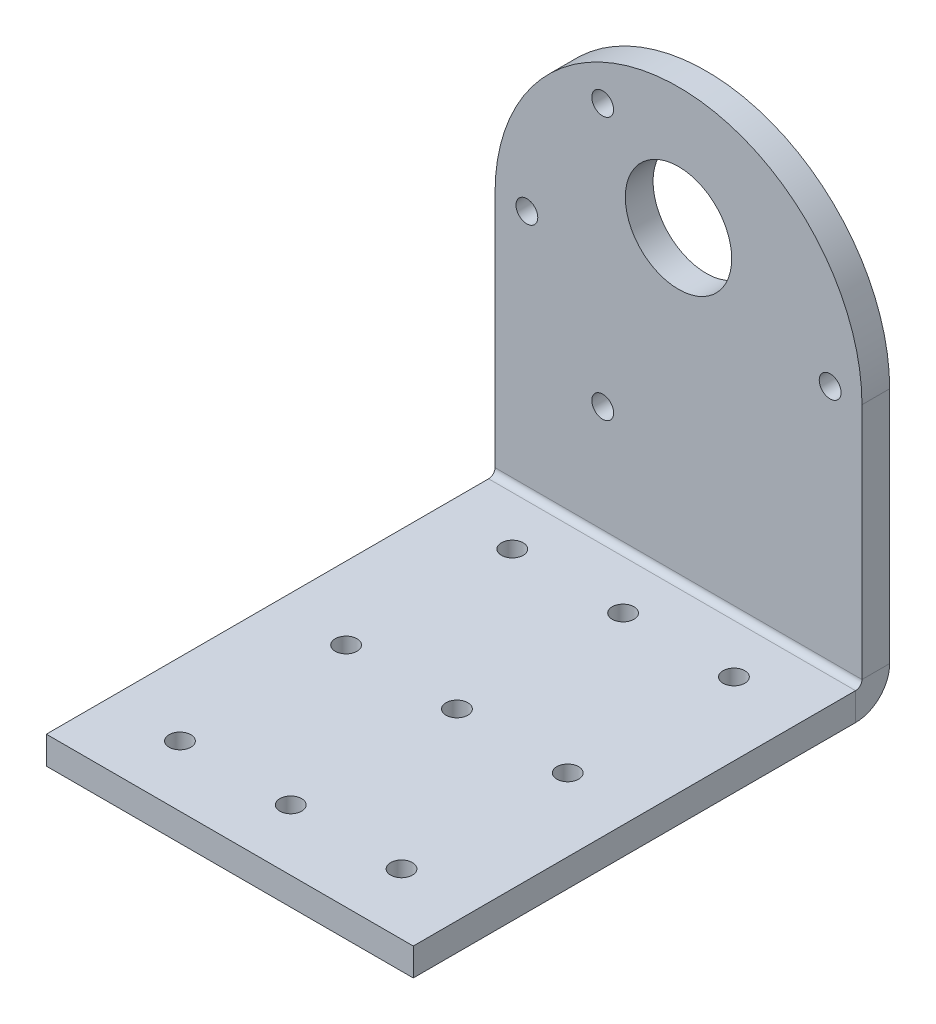
ISO-10303-21;
HEADER;
FILE_DESCRIPTION(('STEP AP214'),'2;1');
FILE_NAME('part.step','',(''),(''),'','','');
FILE_SCHEMA(('AUTOMOTIVE_DESIGN { 1 0 10303 214 1 1 1 1 }'));
ENDSEC;
DATA;
#1=APPLICATION_CONTEXT('core data for automotive mechanical design processes');
#2=APPLICATION_PROTOCOL_DEFINITION('international standard','automotive_design',2000,#1);
#3=PRODUCT_CONTEXT('',#1,'mechanical');
#4=PRODUCT('Part','Part','',(#3));
#5=PRODUCT_RELATED_PRODUCT_CATEGORY('part','',(#4));
#6=PRODUCT_DEFINITION_FORMATION('','',#4);
#7=PRODUCT_DEFINITION_CONTEXT('part definition',#1,'design');
#8=PRODUCT_DEFINITION('design','',#6,#7);
#9=PRODUCT_DEFINITION_SHAPE('','',#8);
#10=(LENGTH_UNIT() NAMED_UNIT(*) SI_UNIT(.MILLI.,.METRE.));
#11=(NAMED_UNIT(*) PLANE_ANGLE_UNIT() SI_UNIT($,.RADIAN.));
#12=(NAMED_UNIT(*) SI_UNIT($,.STERADIAN.) SOLID_ANGLE_UNIT());
#13=UNCERTAINTY_MEASURE_WITH_UNIT(LENGTH_MEASURE(1.E-05),#10,'distance_accuracy_value','');
#14=(GEOMETRIC_REPRESENTATION_CONTEXT(3) GLOBAL_UNCERTAINTY_ASSIGNED_CONTEXT((#13)) GLOBAL_UNIT_ASSIGNED_CONTEXT((#10,
#11,#12)) REPRESENTATION_CONTEXT('',''));
#15=CARTESIAN_POINT('',(0.,0.,0.));
#16=DIRECTION('',(0.,0.,1.));
#17=DIRECTION('',(1.,0.,0.));
#18=AXIS2_PLACEMENT_3D('',#15,#16,#17);
#19=CARTESIAN_POINT('',(0.,31.1912,-3.175));
#20=DIRECTION('',(0.,0.,1.));
#21=DIRECTION('',(1.,0.,0.));
#22=AXIS2_PLACEMENT_3D('',#19,#20,#21);
#23=PLANE('',#22);
#24=CARTESIAN_POINT('',(0.,38.227,-3.175));
#25=DIRECTION('',(0.,0.,-1.));
#26=DIRECTION('',(-1.,0.,0.));
#27=AXIS2_PLACEMENT_3D('',#24,#25,#26);
#28=CIRCLE('',#27,6.096);
#29=CARTESIAN_POINT('',(-6.096,38.227,-3.175));
#30=VERTEX_POINT('',#29);
#31=EDGE_CURVE('E135',#30,#30,#28,.T.);
#32=ORIENTED_EDGE('',*,*,#31,.F.);
#33=EDGE_LOOP('',(#32));
#34=FACE_BOUND('',#33,.T.);
#35=CARTESIAN_POINT('',(-8.69060000000017,46.243760748258,-3.175));
#36=DIRECTION('',(0.,0.,-1.));
#37=DIRECTION('',(-1.,0.,0.));
#38=AXIS2_PLACEMENT_3D('',#35,#36,#37);
#39=CIRCLE('',#38,1.24999999999999);
#40=CARTESIAN_POINT('',(-9.94060000000016,46.243760748258,-3.175));
#41=VERTEX_POINT('',#40);
#42=EDGE_CURVE('E124',#41,#41,#39,.T.);
#43=ORIENTED_EDGE('',*,*,#42,.F.);
#44=EDGE_LOOP('',(#43));
#45=FACE_BOUND('',#44,.T.);
#46=DIRECTION('',(1.,0.,0.));
#47=VECTOR('',#46,1.);
#48=CARTESIAN_POINT('',(21.0312,3.9116,-3.175));
#49=LINE('',#48,#47);
#50=CARTESIAN_POINT('',(21.0312,3.9116,-3.175));
#51=VERTEX_POINT('',#50);
#52=CARTESIAN_POINT('',(-21.0312,3.91160000000002,-3.175));
#53=VERTEX_POINT('',#52);
#54=EDGE_CURVE('E238',#51,#53,#49,.F.);
#55=ORIENTED_EDGE('',*,*,#54,.T.);
#56=DIRECTION('',(0.,-1.,0.));
#57=VECTOR('',#56,1.);
#58=CARTESIAN_POINT('',(-21.0312,0.,-3.175));
#59=LINE('',#58,#57);
#60=CARTESIAN_POINT('',(-21.0312,31.1912,-3.175));
#61=VERTEX_POINT('',#60);
#62=EDGE_CURVE('E110',#61,#53,#59,.T.);
#63=ORIENTED_EDGE('',*,*,#62,.F.);
#64=CARTESIAN_POINT('',(0.,31.1912,-3.175));
#65=DIRECTION('',(0.,0.,1.));
#66=DIRECTION('',(1.,0.,0.));
#67=AXIS2_PLACEMENT_3D('',#64,#65,#66);
#68=CIRCLE('',#67,21.0312);
#69=CARTESIAN_POINT('',(21.0312,31.1912,-3.175));
#70=VERTEX_POINT('',#69);
#71=EDGE_CURVE('E100',#70,#61,#68,.T.);
#72=ORIENTED_EDGE('',*,*,#71,.F.);
#73=DIRECTION('',(0.,1.,0.));
#74=VECTOR('',#73,1.);
#75=CARTESIAN_POINT('',(21.0312,0.,-3.175));
#76=LINE('',#75,#74);
#77=EDGE_CURVE('E112',#51,#70,#76,.T.);
#78=ORIENTED_EDGE('',*,*,#77,.F.);
#79=EDGE_LOOP('',(#55,#63,#72,#78));
#80=FACE_BOUND('',#79,.T.);
#81=CARTESIAN_POINT('',(-17.3812,31.1912,-3.175));
#82=DIRECTION('',(0.,0.,-1.));
#83=DIRECTION('',(-1.,0.,0.));
#84=AXIS2_PLACEMENT_3D('',#81,#82,#83);
#85=CIRCLE('',#84,1.24999999999999);
#86=CARTESIAN_POINT('',(-18.6312,31.1912,-3.175));
#87=VERTEX_POINT('',#86);
#88=EDGE_CURVE('E119',#87,#87,#85,.T.);
#89=ORIENTED_EDGE('',*,*,#88,.F.);
#90=EDGE_LOOP('',(#89));
#91=FACE_BOUND('',#90,.T.);
#92=CARTESIAN_POINT('',(-8.69059999999996,16.1386392517419,-3.175));
#93=DIRECTION('',(0.,0.,-1.));
#94=DIRECTION('',(-1.,0.,0.));
#95=AXIS2_PLACEMENT_3D('',#92,#93,#94);
#96=CIRCLE('',#95,1.24999999999999);
#97=CARTESIAN_POINT('',(-9.94059999999995,16.1386392517419,-3.175));
#98=VERTEX_POINT('',#97);
#99=EDGE_CURVE('E120',#98,#98,#96,.T.);
#100=ORIENTED_EDGE('',*,*,#99,.F.);
#101=EDGE_LOOP('',(#100));
#102=FACE_BOUND('',#101,.T.);
#103=CARTESIAN_POINT('',(17.3812,31.1912,-3.175));
#104=DIRECTION('',(0.,0.,-1.));
#105=DIRECTION('',(-1.,0.,0.));
#106=AXIS2_PLACEMENT_3D('',#103,#104,#105);
#107=CIRCLE('',#106,1.24999999999999);
#108=CARTESIAN_POINT('',(16.1312,31.1912,-3.175));
#109=VERTEX_POINT('',#108);
#110=EDGE_CURVE('E123',#109,#109,#107,.T.);
#111=ORIENTED_EDGE('',*,*,#110,.F.);
#112=EDGE_LOOP('',(#111));
#113=FACE_BOUND('',#112,.T.);
#114=ADVANCED_FACE('F59',(#34,#45,#80,#91,#102,#113),#23,.F.);
#115=CARTESIAN_POINT('',(21.0312,0.,-3.175));
#116=DIRECTION('',(1.,0.,0.));
#117=DIRECTION('',(0.,0.,-1.));
#118=AXIS2_PLACEMENT_3D('',#115,#116,#117);
#119=PLANE('',#118);
#120=DIRECTION('',(0.,1.,0.));
#121=VECTOR('',#120,1.);
#122=CARTESIAN_POINT('',(21.0312,0.,0.));
#123=LINE('',#122,#121);
#124=CARTESIAN_POINT('',(21.0312,3.9116,0.));
#125=VERTEX_POINT('',#124);
#126=CARTESIAN_POINT('',(21.0312,31.1912,0.));
#127=VERTEX_POINT('',#126);
#128=EDGE_CURVE('E106',#125,#127,#123,.T.);
#129=ORIENTED_EDGE('',*,*,#128,.F.);
#130=DIRECTION('',(0.,0.,-1.));
#131=VECTOR('',#130,1.);
#132=CARTESIAN_POINT('',(21.0312,3.9116,0.));
#133=LINE('',#132,#131);
#134=EDGE_CURVE('E245',#125,#51,#133,.T.);
#135=ORIENTED_EDGE('',*,*,#134,.T.);
#136=ORIENTED_EDGE('',*,*,#77,.T.);
#137=DIRECTION('',(0.,0.,1.));
#138=VECTOR('',#137,1.);
#139=CARTESIAN_POINT('',(21.0312,31.1912,-3.175));
#140=LINE('',#139,#138);
#141=EDGE_CURVE('E68',#70,#127,#140,.T.);
#142=ORIENTED_EDGE('',*,*,#141,.T.);
#143=EDGE_LOOP('',(#129,#135,#136,#142));
#144=FACE_BOUND('',#143,.T.);
#145=ADVANCED_FACE('F260',(#144),#119,.T.);
#146=CARTESIAN_POINT('',(0.,31.1912,0.));
#147=DIRECTION('',(0.,0.,1.));
#148=DIRECTION('',(1.,0.,0.));
#149=AXIS2_PLACEMENT_3D('',#146,#147,#148);
#150=PLANE('',#149);
#151=CARTESIAN_POINT('',(0.,38.227,0.));
#152=DIRECTION('',(0.,0.,1.));
#153=DIRECTION('',(1.,0.,0.));
#154=AXIS2_PLACEMENT_3D('',#151,#152,#153);
#155=CIRCLE('',#154,6.096);
#156=CARTESIAN_POINT('',(6.096,38.227,0.));
#157=VERTEX_POINT('',#156);
#158=EDGE_CURVE('E63',#157,#157,#155,.T.);
#159=ORIENTED_EDGE('',*,*,#158,.F.);
#160=EDGE_LOOP('',(#159));
#161=FACE_BOUND('',#160,.T.);
#162=CARTESIAN_POINT('',(-8.69060000000017,46.243760748258,0.));
#163=DIRECTION('',(0.,0.,1.));
#164=DIRECTION('',(1.,0.,0.));
#165=AXIS2_PLACEMENT_3D('',#162,#163,#164);
#166=CIRCLE('',#165,1.24999999999999);
#167=CARTESIAN_POINT('',(-7.44060000000019,46.243760748258,0.));
#168=VERTEX_POINT('',#167);
#169=EDGE_CURVE('E121',#168,#168,#166,.T.);
#170=ORIENTED_EDGE('',*,*,#169,.F.);
#171=EDGE_LOOP('',(#170));
#172=FACE_BOUND('',#171,.T.);
#173=CARTESIAN_POINT('',(17.3812,31.1912,0.));
#174=DIRECTION('',(0.,0.,1.));
#175=DIRECTION('',(1.,0.,0.));
#176=AXIS2_PLACEMENT_3D('',#173,#174,#175);
#177=CIRCLE('',#176,1.24999999999999);
#178=CARTESIAN_POINT('',(18.6312,31.1912,0.));
#179=VERTEX_POINT('',#178);
#180=EDGE_CURVE('E128',#179,#179,#177,.T.);
#181=ORIENTED_EDGE('',*,*,#180,.F.);
#182=EDGE_LOOP('',(#181));
#183=FACE_BOUND('',#182,.T.);
#184=CARTESIAN_POINT('',(-8.69059999999996,16.1386392517419,0.));
#185=DIRECTION('',(0.,0.,1.));
#186=DIRECTION('',(1.,0.,0.));
#187=AXIS2_PLACEMENT_3D('',#184,#185,#186);
#188=CIRCLE('',#187,1.24999999999999);
#189=CARTESIAN_POINT('',(-7.44059999999998,16.1386392517419,0.));
#190=VERTEX_POINT('',#189);
#191=EDGE_CURVE('E117',#190,#190,#188,.T.);
#192=ORIENTED_EDGE('',*,*,#191,.F.);
#193=EDGE_LOOP('',(#192));
#194=FACE_BOUND('',#193,.T.);
#195=CARTESIAN_POINT('',(-17.3812,31.1912,0.));
#196=DIRECTION('',(0.,0.,1.));
#197=DIRECTION('',(1.,0.,0.));
#198=AXIS2_PLACEMENT_3D('',#195,#196,#197);
#199=CIRCLE('',#198,1.24999999999999);
#200=CARTESIAN_POINT('',(-16.1312,31.1912,0.));
#201=VERTEX_POINT('',#200);
#202=EDGE_CURVE('E144',#201,#201,#199,.T.);
#203=ORIENTED_EDGE('',*,*,#202,.F.);
#204=EDGE_LOOP('',(#203));
#205=FACE_BOUND('',#204,.T.);
#206=DIRECTION('',(0.,-1.,0.));
#207=VECTOR('',#206,1.);
#208=CARTESIAN_POINT('',(-21.0312,0.,0.));
#209=LINE('',#208,#207);
#210=CARTESIAN_POINT('',(-21.0312,31.1912,0.));
#211=VERTEX_POINT('',#210);
#212=CARTESIAN_POINT('',(-21.0312,3.9116,0.));
#213=VERTEX_POINT('',#212);
#214=EDGE_CURVE('E102',#211,#213,#209,.T.);
#215=ORIENTED_EDGE('',*,*,#214,.T.);
#216=DIRECTION('',(1.,0.,0.));
#217=VECTOR('',#216,1.);
#218=CARTESIAN_POINT('',(21.0312,3.9116,0.));
#219=LINE('',#218,#217);
#220=EDGE_CURVE('E76',#125,#213,#219,.F.);
#221=ORIENTED_EDGE('',*,*,#220,.F.);
#222=ORIENTED_EDGE('',*,*,#128,.T.);
#223=CARTESIAN_POINT('',(0.,31.1912,0.));
#224=DIRECTION('',(0.,0.,1.));
#225=DIRECTION('',(1.,0.,0.));
#226=AXIS2_PLACEMENT_3D('',#223,#224,#225);
#227=CIRCLE('',#226,21.0312);
#228=EDGE_CURVE('E98',#127,#211,#227,.T.);
#229=ORIENTED_EDGE('',*,*,#228,.T.);
#230=EDGE_LOOP('',(#215,#221,#222,#229));
#231=FACE_BOUND('',#230,.T.);
#232=ADVANCED_FACE('F108',(#161,#172,#183,#194,#205,#231),#150,.T.);
#233=CARTESIAN_POINT('',(-21.0312,0.,-3.175));
#234=DIRECTION('',(-1.,0.,0.));
#235=DIRECTION('',(0.,0.,1.));
#236=AXIS2_PLACEMENT_3D('',#233,#234,#235);
#237=PLANE('',#236);
#238=DIRECTION('',(0.,0.,-1.));
#239=VECTOR('',#238,1.);
#240=CARTESIAN_POINT('',(-21.0312,3.9116,0.));
#241=LINE('',#240,#239);
#242=EDGE_CURVE('E105',#213,#53,#241,.T.);
#243=ORIENTED_EDGE('',*,*,#242,.F.);
#244=ORIENTED_EDGE('',*,*,#214,.F.);
#245=DIRECTION('',(0.,0.,1.));
#246=VECTOR('',#245,1.);
#247=CARTESIAN_POINT('',(-21.0312,31.1912,-3.175));
#248=LINE('',#247,#246);
#249=EDGE_CURVE('E13',#61,#211,#248,.T.);
#250=ORIENTED_EDGE('',*,*,#249,.F.);
#251=ORIENTED_EDGE('',*,*,#62,.T.);
#252=EDGE_LOOP('',(#243,#244,#250,#251));
#253=FACE_BOUND('',#252,.T.);
#254=ADVANCED_FACE('F61',(#253),#237,.T.);
#255=CARTESIAN_POINT('',(0.,31.1912,-3.175));
#256=DIRECTION('',(0.,0.,1.));
#257=DIRECTION('',(1.,0.,0.));
#258=AXIS2_PLACEMENT_3D('',#255,#256,#257);
#259=CYLINDRICAL_SURFACE('',#258,21.0312);
#260=ORIENTED_EDGE('',*,*,#228,.F.);
#261=ORIENTED_EDGE('',*,*,#141,.F.);
#262=ORIENTED_EDGE('',*,*,#71,.T.);
#263=ORIENTED_EDGE('',*,*,#249,.T.);
#264=EDGE_LOOP('',(#260,#261,#262,#263));
#265=FACE_BOUND('',#264,.T.);
#266=ADVANCED_FACE('F95',(#265),#259,.T.);
#267=CARTESIAN_POINT('',(-21.0312,3.9116,0.7366));
#268=DIRECTION('',(-1.,0.,0.));
#269=DIRECTION('',(0.,0.,1.));
#270=AXIS2_PLACEMENT_3D('',#267,#268,#269);
#271=PLANE('',#270);
#272=DIRECTION('',(0.,1.,0.));
#273=VECTOR('',#272,1.);
#274=CARTESIAN_POINT('',(-21.0312,0.,0.736599999999986));
#275=LINE('',#274,#273);
#276=CARTESIAN_POINT('',(-21.0312,3.175,0.736599999999997));
#277=VERTEX_POINT('',#276);
#278=CARTESIAN_POINT('',(-21.0312,0.,0.736599999999986));
#279=VERTEX_POINT('',#278);
#280=EDGE_CURVE('E201',#277,#279,#275,.F.);
#281=ORIENTED_EDGE('',*,*,#280,.F.);
#282=CARTESIAN_POINT('',(-21.0312,3.9116,0.7366));
#283=DIRECTION('',(1.,0.,0.));
#284=DIRECTION('',(0.,0.,-1.));
#285=AXIS2_PLACEMENT_3D('',#282,#283,#284);
#286=CIRCLE('',#285,0.7366);
#287=EDGE_CURVE('E248',#213,#277,#286,.F.);
#288=ORIENTED_EDGE('',*,*,#287,.F.);
#289=ORIENTED_EDGE('',*,*,#242,.T.);
#290=CARTESIAN_POINT('',(-21.0312,3.9116,0.7366));
#291=DIRECTION('',(1.,0.,0.));
#292=DIRECTION('',(0.,0.,-1.));
#293=AXIS2_PLACEMENT_3D('',#290,#291,#292);
#294=CIRCLE('',#293,3.9116);
#295=EDGE_CURVE('E241',#53,#279,#294,.F.);
#296=ORIENTED_EDGE('',*,*,#295,.T.);
#297=EDGE_LOOP('',(#281,#288,#289,#296));
#298=FACE_BOUND('',#297,.T.);
#299=ADVANCED_FACE('F270',(#298),#271,.T.);
#300=CARTESIAN_POINT('',(21.0312,3.9116,0.7366));
#301=DIRECTION('',(-1.,0.,0.));
#302=DIRECTION('',(0.,0.,1.));
#303=AXIS2_PLACEMENT_3D('',#300,#301,#302);
#304=PLANE('',#303);
#305=CARTESIAN_POINT('',(21.0312,3.9116,0.7366));
#306=DIRECTION('',(1.,0.,0.));
#307=DIRECTION('',(0.,0.,-1.));
#308=AXIS2_PLACEMENT_3D('',#305,#306,#307);
#309=CIRCLE('',#308,0.7366);
#310=CARTESIAN_POINT('',(21.0312,3.175,0.736599999999997));
#311=VERTEX_POINT('',#310);
#312=EDGE_CURVE('E205',#311,#125,#309,.T.);
#313=ORIENTED_EDGE('',*,*,#312,.F.);
#314=DIRECTION('',(0.,1.,0.));
#315=VECTOR('',#314,1.);
#316=CARTESIAN_POINT('',(21.0312,3.175,0.736599999999997));
#317=LINE('',#316,#315);
#318=CARTESIAN_POINT('',(21.0312,0.,0.736599999999986));
#319=VERTEX_POINT('',#318);
#320=EDGE_CURVE('E230',#311,#319,#317,.F.);
#321=ORIENTED_EDGE('',*,*,#320,.T.);
#322=CARTESIAN_POINT('',(21.0312,3.9116,0.7366));
#323=DIRECTION('',(1.,0.,0.));
#324=DIRECTION('',(0.,0.,-1.));
#325=AXIS2_PLACEMENT_3D('',#322,#323,#324);
#326=CIRCLE('',#325,3.9116);
#327=EDGE_CURVE('E242',#319,#51,#326,.T.);
#328=ORIENTED_EDGE('',*,*,#327,.T.);
#329=ORIENTED_EDGE('',*,*,#134,.F.);
#330=EDGE_LOOP('',(#313,#321,#328,#329));
#331=FACE_BOUND('',#330,.T.);
#332=ADVANCED_FACE('F314',(#331),#304,.F.);
#333=CARTESIAN_POINT('',(21.0312,3.9116,0.7366));
#334=DIRECTION('',(1.,0.,0.));
#335=DIRECTION('',(0.,-1.,0.));
#336=AXIS2_PLACEMENT_3D('',#333,#334,#335);
#337=CYLINDRICAL_SURFACE('',#336,3.9116);
#338=ORIENTED_EDGE('',*,*,#54,.F.);
#339=ORIENTED_EDGE('',*,*,#327,.F.);
#340=DIRECTION('',(1.,0.,0.));
#341=VECTOR('',#340,1.);
#342=CARTESIAN_POINT('',(-21.0312,0.,0.736599999999986));
#343=LINE('',#342,#341);
#344=EDGE_CURVE('E227',#319,#279,#343,.F.);
#345=ORIENTED_EDGE('',*,*,#344,.T.);
#346=ORIENTED_EDGE('',*,*,#295,.F.);
#347=EDGE_LOOP('',(#338,#339,#345,#346));
#348=FACE_BOUND('',#347,.T.);
#349=ADVANCED_FACE('F273',(#348),#337,.T.);
#350=CARTESIAN_POINT('',(21.0312,3.9116,0.7366));
#351=DIRECTION('',(1.,0.,0.));
#352=DIRECTION('',(0.,-1.,0.));
#353=AXIS2_PLACEMENT_3D('',#350,#351,#352);
#354=CYLINDRICAL_SURFACE('',#353,0.7366);
#355=ORIENTED_EDGE('',*,*,#220,.T.);
#356=ORIENTED_EDGE('',*,*,#287,.T.);
#357=DIRECTION('',(1.,0.,0.));
#358=VECTOR('',#357,1.);
#359=CARTESIAN_POINT('',(-21.0312,3.175,0.736599999999997));
#360=LINE('',#359,#358);
#361=EDGE_CURVE('E233',#277,#311,#360,.T.);
#362=ORIENTED_EDGE('',*,*,#361,.T.);
#363=ORIENTED_EDGE('',*,*,#312,.T.);
#364=EDGE_LOOP('',(#355,#356,#362,#363));
#365=FACE_BOUND('',#364,.T.);
#366=ADVANCED_FACE('F310',(#365),#354,.F.);
#367=CARTESIAN_POINT('',(21.0312,-1.795438797636E-13,51.435));
#368=DIRECTION('',(-1.,0.,0.));
#369=DIRECTION('',(0.,0.,1.));
#370=AXIS2_PLACEMENT_3D('',#367,#368,#369);
#371=PLANE('',#370);
#372=ORIENTED_EDGE('',*,*,#320,.F.);
#373=DIRECTION('',(0.,0.,-1.));
#374=VECTOR('',#373,1.);
#375=CARTESIAN_POINT('',(21.0312,3.17499999999982,51.435));
#376=LINE('',#375,#374);
#377=CARTESIAN_POINT('',(21.0312,3.17499999999982,51.435));
#378=VERTEX_POINT('',#377);
#379=EDGE_CURVE('E224',#311,#378,#376,.F.);
#380=ORIENTED_EDGE('',*,*,#379,.T.);
#381=DIRECTION('',(0.,1.,0.));
#382=VECTOR('',#381,1.);
#383=CARTESIAN_POINT('',(21.0312,-1.795438797636E-13,51.435));
#384=LINE('',#383,#382);
#385=CARTESIAN_POINT('',(21.0312,-1.79584342663397E-13,51.435));
#386=VERTEX_POINT('',#385);
#387=EDGE_CURVE('E202',#386,#378,#384,.T.);
#388=ORIENTED_EDGE('',*,*,#387,.F.);
#389=DIRECTION('',(0.,0.,1.));
#390=VECTOR('',#389,1.);
#391=CARTESIAN_POINT('',(21.0312,0.,0.));
#392=LINE('',#391,#390);
#393=EDGE_CURVE('E215',#319,#386,#392,.T.);
#394=ORIENTED_EDGE('',*,*,#393,.F.);
#395=EDGE_LOOP('',(#372,#380,#388,#394));
#396=FACE_BOUND('',#395,.T.);
#397=ADVANCED_FACE('F289',(#396),#371,.F.);
#398=CARTESIAN_POINT('',(-21.0312,0.,0.));
#399=DIRECTION('',(1.,0.,0.));
#400=DIRECTION('',(0.,0.,-1.));
#401=AXIS2_PLACEMENT_3D('',#398,#399,#400);
#402=PLANE('',#401);
#403=ORIENTED_EDGE('',*,*,#280,.T.);
#404=DIRECTION('',(0.,0.,-1.));
#405=VECTOR('',#404,1.);
#406=CARTESIAN_POINT('',(-21.0312,0.,0.));
#407=LINE('',#406,#405);
#408=CARTESIAN_POINT('',(-21.0312,-1.79584342663397E-13,51.435));
#409=VERTEX_POINT('',#408);
#410=EDGE_CURVE('E209',#409,#279,#407,.T.);
#411=ORIENTED_EDGE('',*,*,#410,.F.);
#412=DIRECTION('',(0.,1.,0.));
#413=VECTOR('',#412,1.);
#414=CARTESIAN_POINT('',(-21.0312,-1.79584342663397E-13,51.435));
#415=LINE('',#414,#413);
#416=CARTESIAN_POINT('',(-21.0312,3.17499999999982,51.435));
#417=VERTEX_POINT('',#416);
#418=EDGE_CURVE('E206',#409,#417,#415,.T.);
#419=ORIENTED_EDGE('',*,*,#418,.T.);
#420=DIRECTION('',(0.,0.,1.));
#421=VECTOR('',#420,1.);
#422=CARTESIAN_POINT('',(-21.0312,3.175,0.));
#423=LINE('',#422,#421);
#424=EDGE_CURVE('E218',#417,#277,#423,.F.);
#425=ORIENTED_EDGE('',*,*,#424,.T.);
#426=EDGE_LOOP('',(#403,#411,#419,#425));
#427=FACE_BOUND('',#426,.T.);
#428=ADVANCED_FACE('F405',(#427),#402,.F.);
#429=CARTESIAN_POINT('',(0.,0.,0.));
#430=DIRECTION('',(0.,1.,0.));
#431=DIRECTION('',(0.,0.,1.));
#432=AXIS2_PLACEMENT_3D('',#429,#430,#431);
#433=PLANE('',#432);
#434=CARTESIAN_POINT('',(12.7,-1.55257751099924E-13,44.45));
#435=DIRECTION('',(0.,1.,0.));
#436=DIRECTION('',(0.,0.,1.));
#437=AXIS2_PLACEMENT_3D('',#434,#435,#436);
#438=CIRCLE('',#437,1.24999999999999);
#439=CARTESIAN_POINT('',(12.7,-1.59622102773478E-13,45.7));
#440=VERTEX_POINT('',#439);
#441=EDGE_CURVE('E150',#440,#440,#438,.T.);
#442=ORIENTED_EDGE('',*,*,#441,.T.);
#443=EDGE_LOOP('',(#442));
#444=FACE_BOUND('',#443,.T.);
#445=CARTESIAN_POINT('',(0.,-1.55257751099924E-13,44.45));
#446=DIRECTION('',(0.,1.,0.));
#447=DIRECTION('',(0.,0.,1.));
#448=AXIS2_PLACEMENT_3D('',#445,#446,#447);
#449=CIRCLE('',#448,1.24999999999999);
#450=CARTESIAN_POINT('',(0.,-1.59622102773478E-13,45.7));
#451=VERTEX_POINT('',#450);
#452=EDGE_CURVE('E156',#451,#451,#449,.T.);
#453=ORIENTED_EDGE('',*,*,#452,.T.);
#454=EDGE_LOOP('',(#453));
#455=FACE_BOUND('',#454,.T.);
#456=CARTESIAN_POINT('',(-12.7,-1.55257751099924E-13,44.45));
#457=DIRECTION('',(0.,1.,0.));
#458=DIRECTION('',(0.,0.,1.));
#459=AXIS2_PLACEMENT_3D('',#456,#457,#458);
#460=CIRCLE('',#459,1.24999999999999);
#461=CARTESIAN_POINT('',(-12.7,-1.59622102773478E-13,45.7));
#462=VERTEX_POINT('',#461);
#463=EDGE_CURVE('E162',#462,#462,#460,.T.);
#464=ORIENTED_EDGE('',*,*,#463,.T.);
#465=EDGE_LOOP('',(#464));
#466=FACE_BOUND('',#465,.T.);
#467=CARTESIAN_POINT('',(12.7,0.,25.4));
#468=DIRECTION('',(0.,1.,0.));
#469=DIRECTION('',(0.,0.,1.));
#470=AXIS2_PLACEMENT_3D('',#467,#468,#469);
#471=CIRCLE('',#470,1.24999999999999);
#472=CARTESIAN_POINT('',(12.7,0.,26.65));
#473=VERTEX_POINT('',#472);
#474=EDGE_CURVE('E168',#473,#473,#471,.T.);
#475=ORIENTED_EDGE('',*,*,#474,.T.);
#476=EDGE_LOOP('',(#475));
#477=FACE_BOUND('',#476,.T.);
#478=CARTESIAN_POINT('',(0.,0.,25.4));
#479=DIRECTION('',(0.,1.,0.));
#480=DIRECTION('',(0.,0.,1.));
#481=AXIS2_PLACEMENT_3D('',#478,#479,#480);
#482=CIRCLE('',#481,1.24999999999999);
#483=CARTESIAN_POINT('',(0.,0.,26.65));
#484=VERTEX_POINT('',#483);
#485=EDGE_CURVE('E174',#484,#484,#482,.T.);
#486=ORIENTED_EDGE('',*,*,#485,.T.);
#487=EDGE_LOOP('',(#486));
#488=FACE_BOUND('',#487,.T.);
#489=CARTESIAN_POINT('',(-12.7,0.,25.4));
#490=DIRECTION('',(0.,1.,0.));
#491=DIRECTION('',(0.,0.,1.));
#492=AXIS2_PLACEMENT_3D('',#489,#490,#491);
#493=CIRCLE('',#492,1.24999999999999);
#494=CARTESIAN_POINT('',(-12.7,0.,26.65));
#495=VERTEX_POINT('',#494);
#496=EDGE_CURVE('E180',#495,#495,#493,.T.);
#497=ORIENTED_EDGE('',*,*,#496,.T.);
#498=EDGE_LOOP('',(#497));
#499=FACE_BOUND('',#498,.T.);
#500=CARTESIAN_POINT('',(12.7,0.,6.35));
#501=DIRECTION('',(0.,1.,0.));
#502=DIRECTION('',(0.,0.,1.));
#503=AXIS2_PLACEMENT_3D('',#500,#501,#502);
#504=CIRCLE('',#503,1.24999999999999);
#505=CARTESIAN_POINT('',(12.7,0.,7.59999999999999));
#506=VERTEX_POINT('',#505);
#507=EDGE_CURVE('E186',#506,#506,#504,.T.);
#508=ORIENTED_EDGE('',*,*,#507,.T.);
#509=EDGE_LOOP('',(#508));
#510=FACE_BOUND('',#509,.T.);
#511=CARTESIAN_POINT('',(0.,0.,6.35));
#512=DIRECTION('',(0.,1.,0.));
#513=DIRECTION('',(0.,0.,1.));
#514=AXIS2_PLACEMENT_3D('',#511,#512,#513);
#515=CIRCLE('',#514,1.24999999999999);
#516=CARTESIAN_POINT('',(0.,0.,7.59999999999999));
#517=VERTEX_POINT('',#516);
#518=EDGE_CURVE('E192',#517,#517,#515,.T.);
#519=ORIENTED_EDGE('',*,*,#518,.T.);
#520=EDGE_LOOP('',(#519));
#521=FACE_BOUND('',#520,.T.);
#522=CARTESIAN_POINT('',(-12.7,0.,6.35));
#523=DIRECTION('',(0.,1.,0.));
#524=DIRECTION('',(0.,0.,1.));
#525=AXIS2_PLACEMENT_3D('',#522,#523,#524);
#526=CIRCLE('',#525,1.24999999999999);
#527=CARTESIAN_POINT('',(-12.7,0.,7.59999999999999));
#528=VERTEX_POINT('',#527);
#529=EDGE_CURVE('E198',#528,#528,#526,.T.);
#530=ORIENTED_EDGE('',*,*,#529,.T.);
#531=EDGE_LOOP('',(#530));
#532=FACE_BOUND('',#531,.T.);
#533=ORIENTED_EDGE('',*,*,#344,.F.);
#534=ORIENTED_EDGE('',*,*,#393,.T.);
#535=DIRECTION('',(-1.,0.,0.));
#536=VECTOR('',#535,1.);
#537=CARTESIAN_POINT('',(0.,-1.79584342663397E-13,51.435));
#538=LINE('',#537,#536);
#539=EDGE_CURVE('E212',#386,#409,#538,.T.);
#540=ORIENTED_EDGE('',*,*,#539,.T.);
#541=ORIENTED_EDGE('',*,*,#410,.T.);
#542=EDGE_LOOP('',(#533,#534,#540,#541));
#543=FACE_BOUND('',#542,.T.);
#544=ADVANCED_FACE('F281',(#444,#455,#466,#477,#488,#499,#510,#521,#532,#543),#433,.F.);
#545=CARTESIAN_POINT('',(0.,3.175,0.));
#546=DIRECTION('',(0.,1.,0.));
#547=DIRECTION('',(0.,0.,1.));
#548=AXIS2_PLACEMENT_3D('',#545,#546,#547);
#549=PLANE('',#548);
#550=CARTESIAN_POINT('',(12.7,3.17499999999985,44.45));
#551=DIRECTION('',(0.,1.,0.));
#552=DIRECTION('',(0.,0.,1.));
#553=AXIS2_PLACEMENT_3D('',#550,#551,#552);
#554=CIRCLE('',#553,1.24999999999999);
#555=CARTESIAN_POINT('',(12.7,3.17499999999984,45.7));
#556=VERTEX_POINT('',#555);
#557=EDGE_CURVE('E147',#556,#556,#554,.T.);
#558=ORIENTED_EDGE('',*,*,#557,.F.);
#559=EDGE_LOOP('',(#558));
#560=FACE_BOUND('',#559,.T.);
#561=CARTESIAN_POINT('',(0.,3.17499999999985,44.45));
#562=DIRECTION('',(0.,1.,0.));
#563=DIRECTION('',(0.,0.,1.));
#564=AXIS2_PLACEMENT_3D('',#561,#562,#563);
#565=CIRCLE('',#564,1.24999999999999);
#566=CARTESIAN_POINT('',(0.,3.17499999999984,45.7));
#567=VERTEX_POINT('',#566);
#568=EDGE_CURVE('E153',#567,#567,#565,.T.);
#569=ORIENTED_EDGE('',*,*,#568,.F.);
#570=EDGE_LOOP('',(#569));
#571=FACE_BOUND('',#570,.T.);
#572=CARTESIAN_POINT('',(-12.7,3.17499999999985,44.45));
#573=DIRECTION('',(0.,1.,0.));
#574=DIRECTION('',(0.,0.,1.));
#575=AXIS2_PLACEMENT_3D('',#572,#573,#574);
#576=CIRCLE('',#575,1.24999999999999);
#577=CARTESIAN_POINT('',(-12.7,3.17499999999984,45.7));
#578=VERTEX_POINT('',#577);
#579=EDGE_CURVE('E159',#578,#578,#576,.T.);
#580=ORIENTED_EDGE('',*,*,#579,.F.);
#581=EDGE_LOOP('',(#580));
#582=FACE_BOUND('',#581,.T.);
#583=CARTESIAN_POINT('',(12.7,3.17499999999991,25.4));
#584=DIRECTION('',(0.,1.,0.));
#585=DIRECTION('',(0.,0.,1.));
#586=AXIS2_PLACEMENT_3D('',#583,#584,#585);
#587=CIRCLE('',#586,1.24999999999999);
#588=CARTESIAN_POINT('',(12.7,3.17499999999991,26.65));
#589=VERTEX_POINT('',#588);
#590=EDGE_CURVE('E165',#589,#589,#587,.T.);
#591=ORIENTED_EDGE('',*,*,#590,.F.);
#592=EDGE_LOOP('',(#591));
#593=FACE_BOUND('',#592,.T.);
#594=CARTESIAN_POINT('',(0.,3.17499999999991,25.4));
#595=DIRECTION('',(0.,1.,0.));
#596=DIRECTION('',(0.,0.,1.));
#597=AXIS2_PLACEMENT_3D('',#594,#595,#596);
#598=CIRCLE('',#597,1.24999999999999);
#599=CARTESIAN_POINT('',(0.,3.17499999999991,26.65));
#600=VERTEX_POINT('',#599);
#601=EDGE_CURVE('E171',#600,#600,#598,.T.);
#602=ORIENTED_EDGE('',*,*,#601,.F.);
#603=EDGE_LOOP('',(#602));
#604=FACE_BOUND('',#603,.T.);
#605=CARTESIAN_POINT('',(-12.7,3.17499999999991,25.4));
#606=DIRECTION('',(0.,1.,0.));
#607=DIRECTION('',(0.,0.,1.));
#608=AXIS2_PLACEMENT_3D('',#605,#606,#607);
#609=CIRCLE('',#608,1.24999999999999);
#610=CARTESIAN_POINT('',(-12.7,3.17499999999991,26.65));
#611=VERTEX_POINT('',#610);
#612=EDGE_CURVE('E177',#611,#611,#609,.T.);
#613=ORIENTED_EDGE('',*,*,#612,.F.);
#614=EDGE_LOOP('',(#613));
#615=FACE_BOUND('',#614,.T.);
#616=CARTESIAN_POINT('',(12.7,3.17499999999998,6.35000000000001));
#617=DIRECTION('',(0.,1.,0.));
#618=DIRECTION('',(0.,0.,1.));
#619=AXIS2_PLACEMENT_3D('',#616,#617,#618);
#620=CIRCLE('',#619,1.24999999999999);
#621=CARTESIAN_POINT('',(12.7,3.17499999999997,7.6));
#622=VERTEX_POINT('',#621);
#623=EDGE_CURVE('E183',#622,#622,#620,.T.);
#624=ORIENTED_EDGE('',*,*,#623,.F.);
#625=EDGE_LOOP('',(#624));
#626=FACE_BOUND('',#625,.T.);
#627=CARTESIAN_POINT('',(0.,3.17499999999998,6.35000000000001));
#628=DIRECTION('',(0.,1.,0.));
#629=DIRECTION('',(0.,0.,1.));
#630=AXIS2_PLACEMENT_3D('',#627,#628,#629);
#631=CIRCLE('',#630,1.24999999999999);
#632=CARTESIAN_POINT('',(0.,3.17499999999997,7.6));
#633=VERTEX_POINT('',#632);
#634=EDGE_CURVE('E189',#633,#633,#631,.T.);
#635=ORIENTED_EDGE('',*,*,#634,.F.);
#636=EDGE_LOOP('',(#635));
#637=FACE_BOUND('',#636,.T.);
#638=CARTESIAN_POINT('',(-12.7,3.17499999999998,6.35000000000001));
#639=DIRECTION('',(0.,1.,0.));
#640=DIRECTION('',(0.,0.,1.));
#641=AXIS2_PLACEMENT_3D('',#638,#639,#640);
#642=CIRCLE('',#641,1.24999999999999);
#643=CARTESIAN_POINT('',(-12.7,3.17499999999997,7.6));
#644=VERTEX_POINT('',#643);
#645=EDGE_CURVE('E195',#644,#644,#642,.T.);
#646=ORIENTED_EDGE('',*,*,#645,.F.);
#647=EDGE_LOOP('',(#646));
#648=FACE_BOUND('',#647,.T.);
#649=ORIENTED_EDGE('',*,*,#379,.F.);
#650=ORIENTED_EDGE('',*,*,#361,.F.);
#651=ORIENTED_EDGE('',*,*,#424,.F.);
#652=DIRECTION('',(1.,0.,0.));
#653=VECTOR('',#652,1.);
#654=CARTESIAN_POINT('',(-21.0312,3.17499999999982,51.435));
#655=LINE('',#654,#653);
#656=EDGE_CURVE('E221',#378,#417,#655,.F.);
#657=ORIENTED_EDGE('',*,*,#656,.F.);
#658=EDGE_LOOP('',(#649,#650,#651,#657));
#659=FACE_BOUND('',#658,.T.);
#660=ADVANCED_FACE('F426',(#560,#571,#582,#593,#604,#615,#626,#637,#648,#659),#549,.T.);
#661=CARTESIAN_POINT('',(-21.0312,-1.795438797636E-13,51.435));
#662=DIRECTION('',(0.,0.,-1.));
#663=DIRECTION('',(0.,1.,0.));
#664=AXIS2_PLACEMENT_3D('',#661,#662,#663);
#665=PLANE('',#664);
#666=ORIENTED_EDGE('',*,*,#656,.T.);
#667=ORIENTED_EDGE('',*,*,#418,.F.);
#668=ORIENTED_EDGE('',*,*,#539,.F.);
#669=ORIENTED_EDGE('',*,*,#387,.T.);
#670=EDGE_LOOP('',(#666,#667,#668,#669));
#671=FACE_BOUND('',#670,.T.);
#672=ADVANCED_FACE('F298',(#671),#665,.F.);
#673=CARTESIAN_POINT('',(-12.7,3.17499999999998,6.35000000000001));
#674=DIRECTION('',(0.,1.,0.));
#675=DIRECTION('',(0.,0.,1.));
#676=AXIS2_PLACEMENT_3D('',#673,#674,#675);
#677=CYLINDRICAL_SURFACE('',#676,1.24999999999999);
#678=ORIENTED_EDGE('',*,*,#645,.T.);
#679=EDGE_LOOP('',(#678));
#680=FACE_BOUND('',#679,.T.);
#681=ORIENTED_EDGE('',*,*,#529,.F.);
#682=EDGE_LOOP('',(#681));
#683=FACE_BOUND('',#682,.T.);
#684=ADVANCED_FACE('F448',(#680,#683),#677,.F.);
#685=CARTESIAN_POINT('',(0.,3.17499999999998,6.35000000000001));
#686=DIRECTION('',(0.,1.,0.));
#687=DIRECTION('',(0.,0.,1.));
#688=AXIS2_PLACEMENT_3D('',#685,#686,#687);
#689=CYLINDRICAL_SURFACE('',#688,1.24999999999999);
#690=ORIENTED_EDGE('',*,*,#634,.T.);
#691=EDGE_LOOP('',(#690));
#692=FACE_BOUND('',#691,.T.);
#693=ORIENTED_EDGE('',*,*,#518,.F.);
#694=EDGE_LOOP('',(#693));
#695=FACE_BOUND('',#694,.T.);
#696=ADVANCED_FACE('F457',(#692,#695),#689,.F.);
#697=CARTESIAN_POINT('',(12.7,3.17499999999998,6.35000000000001));
#698=DIRECTION('',(0.,1.,0.));
#699=DIRECTION('',(0.,0.,1.));
#700=AXIS2_PLACEMENT_3D('',#697,#698,#699);
#701=CYLINDRICAL_SURFACE('',#700,1.24999999999999);
#702=ORIENTED_EDGE('',*,*,#623,.T.);
#703=EDGE_LOOP('',(#702));
#704=FACE_BOUND('',#703,.T.);
#705=ORIENTED_EDGE('',*,*,#507,.F.);
#706=EDGE_LOOP('',(#705));
#707=FACE_BOUND('',#706,.T.);
#708=ADVANCED_FACE('F466',(#704,#707),#701,.F.);
#709=CARTESIAN_POINT('',(-12.7,3.17499999999991,25.4));
#710=DIRECTION('',(0.,1.,0.));
#711=DIRECTION('',(0.,0.,1.));
#712=AXIS2_PLACEMENT_3D('',#709,#710,#711);
#713=CYLINDRICAL_SURFACE('',#712,1.24999999999999);
#714=ORIENTED_EDGE('',*,*,#612,.T.);
#715=EDGE_LOOP('',(#714));
#716=FACE_BOUND('',#715,.T.);
#717=ORIENTED_EDGE('',*,*,#496,.F.);
#718=EDGE_LOOP('',(#717));
#719=FACE_BOUND('',#718,.T.);
#720=ADVANCED_FACE('F476',(#716,#719),#713,.F.);
#721=CARTESIAN_POINT('',(0.,3.17499999999991,25.4));
#722=DIRECTION('',(0.,1.,0.));
#723=DIRECTION('',(0.,0.,1.));
#724=AXIS2_PLACEMENT_3D('',#721,#722,#723);
#725=CYLINDRICAL_SURFACE('',#724,1.24999999999999);
#726=ORIENTED_EDGE('',*,*,#601,.T.);
#727=EDGE_LOOP('',(#726));
#728=FACE_BOUND('',#727,.T.);
#729=ORIENTED_EDGE('',*,*,#485,.F.);
#730=EDGE_LOOP('',(#729));
#731=FACE_BOUND('',#730,.T.);
#732=ADVANCED_FACE('F486',(#728,#731),#725,.F.);
#733=CARTESIAN_POINT('',(12.7,3.17499999999991,25.4));
#734=DIRECTION('',(0.,1.,0.));
#735=DIRECTION('',(0.,0.,1.));
#736=AXIS2_PLACEMENT_3D('',#733,#734,#735);
#737=CYLINDRICAL_SURFACE('',#736,1.24999999999999);
#738=ORIENTED_EDGE('',*,*,#590,.T.);
#739=EDGE_LOOP('',(#738));
#740=FACE_BOUND('',#739,.T.);
#741=ORIENTED_EDGE('',*,*,#474,.F.);
#742=EDGE_LOOP('',(#741));
#743=FACE_BOUND('',#742,.T.);
#744=ADVANCED_FACE('F496',(#740,#743),#737,.F.);
#745=CARTESIAN_POINT('',(-12.7,3.17499999999984,44.45));
#746=DIRECTION('',(0.,1.,0.));
#747=DIRECTION('',(0.,0.,1.));
#748=AXIS2_PLACEMENT_3D('',#745,#746,#747);
#749=CYLINDRICAL_SURFACE('',#748,1.24999999999999);
#750=ORIENTED_EDGE('',*,*,#579,.T.);
#751=EDGE_LOOP('',(#750));
#752=FACE_BOUND('',#751,.T.);
#753=ORIENTED_EDGE('',*,*,#463,.F.);
#754=EDGE_LOOP('',(#753));
#755=FACE_BOUND('',#754,.T.);
#756=ADVANCED_FACE('F506',(#752,#755),#749,.F.);
#757=CARTESIAN_POINT('',(0.,3.17499999999984,44.45));
#758=DIRECTION('',(0.,1.,0.));
#759=DIRECTION('',(0.,0.,1.));
#760=AXIS2_PLACEMENT_3D('',#757,#758,#759);
#761=CYLINDRICAL_SURFACE('',#760,1.24999999999999);
#762=ORIENTED_EDGE('',*,*,#568,.T.);
#763=EDGE_LOOP('',(#762));
#764=FACE_BOUND('',#763,.T.);
#765=ORIENTED_EDGE('',*,*,#452,.F.);
#766=EDGE_LOOP('',(#765));
#767=FACE_BOUND('',#766,.T.);
#768=ADVANCED_FACE('F516',(#764,#767),#761,.F.);
#769=CARTESIAN_POINT('',(12.7,3.17499999999984,44.45));
#770=DIRECTION('',(0.,1.,0.));
#771=DIRECTION('',(0.,0.,1.));
#772=AXIS2_PLACEMENT_3D('',#769,#770,#771);
#773=CYLINDRICAL_SURFACE('',#772,1.24999999999999);
#774=ORIENTED_EDGE('',*,*,#557,.T.);
#775=EDGE_LOOP('',(#774));
#776=FACE_BOUND('',#775,.T.);
#777=ORIENTED_EDGE('',*,*,#441,.F.);
#778=EDGE_LOOP('',(#777));
#779=FACE_BOUND('',#778,.T.);
#780=ADVANCED_FACE('F526',(#776,#779),#773,.F.);
#781=CARTESIAN_POINT('',(-17.3812,31.1912,-3.175));
#782=DIRECTION('',(0.,0.,-1.));
#783=DIRECTION('',(-1.,0.,0.));
#784=AXIS2_PLACEMENT_3D('',#781,#782,#783);
#785=CYLINDRICAL_SURFACE('',#784,1.24999999999999);
#786=ORIENTED_EDGE('',*,*,#202,.T.);
#787=EDGE_LOOP('',(#786));
#788=FACE_BOUND('',#787,.T.);
#789=ORIENTED_EDGE('',*,*,#88,.T.);
#790=EDGE_LOOP('',(#789));
#791=FACE_BOUND('',#790,.T.);
#792=ADVANCED_FACE('F536',(#788,#791),#785,.F.);
#793=CARTESIAN_POINT('',(-8.69059999999996,16.1386392517419,-3.175));
#794=DIRECTION('',(0.,0.,-1.));
#795=DIRECTION('',(-1.,0.,0.));
#796=AXIS2_PLACEMENT_3D('',#793,#794,#795);
#797=CYLINDRICAL_SURFACE('',#796,1.24999999999999);
#798=ORIENTED_EDGE('',*,*,#191,.T.);
#799=EDGE_LOOP('',(#798));
#800=FACE_BOUND('',#799,.T.);
#801=ORIENTED_EDGE('',*,*,#99,.T.);
#802=EDGE_LOOP('',(#801));
#803=FACE_BOUND('',#802,.T.);
#804=ADVANCED_FACE('F546',(#800,#803),#797,.F.);
#805=CARTESIAN_POINT('',(17.3812,31.1912,-3.175));
#806=DIRECTION('',(0.,0.,-1.));
#807=DIRECTION('',(-1.,0.,0.));
#808=AXIS2_PLACEMENT_3D('',#805,#806,#807);
#809=CYLINDRICAL_SURFACE('',#808,1.24999999999999);
#810=ORIENTED_EDGE('',*,*,#180,.T.);
#811=EDGE_LOOP('',(#810));
#812=FACE_BOUND('',#811,.T.);
#813=ORIENTED_EDGE('',*,*,#110,.T.);
#814=EDGE_LOOP('',(#813));
#815=FACE_BOUND('',#814,.T.);
#816=ADVANCED_FACE('F563',(#812,#815),#809,.F.);
#817=CARTESIAN_POINT('',(-8.69060000000017,46.243760748258,-3.175));
#818=DIRECTION('',(0.,0.,-1.));
#819=DIRECTION('',(-1.,0.,0.));
#820=AXIS2_PLACEMENT_3D('',#817,#818,#819);
#821=CYLINDRICAL_SURFACE('',#820,1.24999999999999);
#822=ORIENTED_EDGE('',*,*,#169,.T.);
#823=EDGE_LOOP('',(#822));
#824=FACE_BOUND('',#823,.T.);
#825=ORIENTED_EDGE('',*,*,#42,.T.);
#826=EDGE_LOOP('',(#825));
#827=FACE_BOUND('',#826,.T.);
#828=ADVANCED_FACE('F573',(#824,#827),#821,.F.);
#829=CARTESIAN_POINT('',(0.,38.227,6.825));
#830=DIRECTION('',(0.,0.,-1.));
#831=DIRECTION('',(-1.,0.,0.));
#832=AXIS2_PLACEMENT_3D('',#829,#830,#831);
#833=CYLINDRICAL_SURFACE('',#832,6.096);
#834=ORIENTED_EDGE('',*,*,#158,.T.);
#835=EDGE_LOOP('',(#834));
#836=FACE_BOUND('',#835,.T.);
#837=ORIENTED_EDGE('',*,*,#31,.T.);
#838=EDGE_LOOP('',(#837));
#839=FACE_BOUND('',#838,.T.);
#840=ADVANCED_FACE('F582',(#836,#839),#833,.F.);
#841=CLOSED_SHELL('',(#114,#145,#232,#254,#266,#299,#332,#349,#366,#397,#428,#544,#660,#672,
#684,#696,#708,#720,#732,#744,#756,#768,#780,#792,#804,#816,#828,#840));
#842=MANIFOLD_SOLID_BREP('B2',#841);
#843=ADVANCED_BREP_SHAPE_REPRESENTATION('',(#18,#842),#14);
#844=SHAPE_DEFINITION_REPRESENTATION(#9,#843);
ENDSEC;
END-ISO-10303-21;
